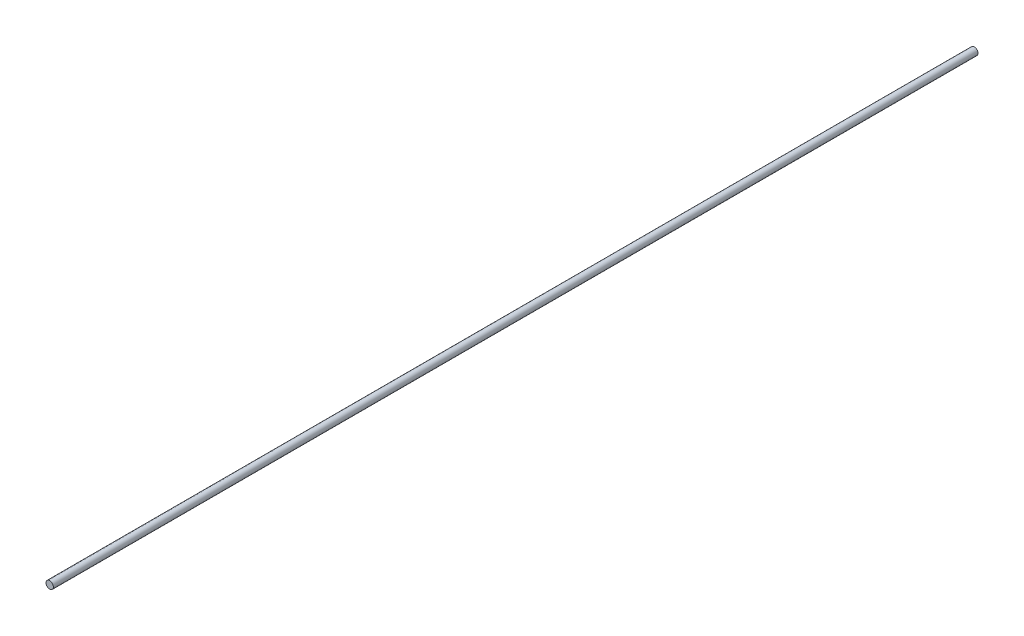
ISO-10303-21;
HEADER;
FILE_DESCRIPTION(('STEP AP214'),'2;1');
FILE_NAME('part.step','',(''),(''),'','','');
FILE_SCHEMA(('AUTOMOTIVE_DESIGN { 1 0 10303 214 1 1 1 1 }'));
ENDSEC;
DATA;
#1=APPLICATION_CONTEXT('core data for automotive mechanical design processes');
#2=APPLICATION_PROTOCOL_DEFINITION('international standard','automotive_design',2000,#1);
#3=PRODUCT_CONTEXT('',#1,'mechanical');
#4=PRODUCT('Part','Part','',(#3));
#5=PRODUCT_RELATED_PRODUCT_CATEGORY('part','',(#4));
#6=PRODUCT_DEFINITION_FORMATION('','',#4);
#7=PRODUCT_DEFINITION_CONTEXT('part definition',#1,'design');
#8=PRODUCT_DEFINITION('design','',#6,#7);
#9=PRODUCT_DEFINITION_SHAPE('','',#8);
#10=(LENGTH_UNIT() NAMED_UNIT(*) SI_UNIT(.MILLI.,.METRE.));
#11=(NAMED_UNIT(*) PLANE_ANGLE_UNIT() SI_UNIT($,.RADIAN.));
#12=(NAMED_UNIT(*) SI_UNIT($,.STERADIAN.) SOLID_ANGLE_UNIT());
#13=UNCERTAINTY_MEASURE_WITH_UNIT(LENGTH_MEASURE(1.E-05),#10,'distance_accuracy_value','');
#14=(GEOMETRIC_REPRESENTATION_CONTEXT(3) GLOBAL_UNCERTAINTY_ASSIGNED_CONTEXT((#13)) GLOBAL_UNIT_ASSIGNED_CONTEXT((#10,
#11,#12)) REPRESENTATION_CONTEXT('',''));
#15=CARTESIAN_POINT('',(0.,0.,0.));
#16=DIRECTION('',(0.,0.,1.));
#17=DIRECTION('',(1.,0.,0.));
#18=AXIS2_PLACEMENT_3D('',#15,#16,#17);
#19=CARTESIAN_POINT('',(0.,0.,500.));
#20=DIRECTION('',(0.,0.,-1.));
#21=DIRECTION('',(-1.,0.,0.));
#22=AXIS2_PLACEMENT_3D('',#19,#20,#21);
#23=CYLINDRICAL_SURFACE('',#22,4.);
#24=CARTESIAN_POINT('',(0.,0.,500.));
#25=DIRECTION('',(0.,0.,1.));
#26=DIRECTION('',(1.,0.,0.));
#27=AXIS2_PLACEMENT_3D('',#24,#25,#26);
#28=CIRCLE('',#27,4.);
#29=CARTESIAN_POINT('',(4.,0.,500.));
#30=VERTEX_POINT('',#29);
#31=EDGE_CURVE('E10',#30,#30,#28,.T.);
#32=ORIENTED_EDGE('',*,*,#31,.F.);
#33=EDGE_LOOP('',(#32));
#34=FACE_BOUND('',#33,.T.);
#35=CARTESIAN_POINT('',(0.,0.,-500.));
#36=DIRECTION('',(0.,0.,1.));
#37=DIRECTION('',(1.,0.,0.));
#38=AXIS2_PLACEMENT_3D('',#35,#36,#37);
#39=CIRCLE('',#38,4.);
#40=CARTESIAN_POINT('',(4.,0.,-500.));
#41=VERTEX_POINT('',#40);
#42=EDGE_CURVE('E43',#41,#41,#39,.T.);
#43=ORIENTED_EDGE('',*,*,#42,.T.);
#44=EDGE_LOOP('',(#43));
#45=FACE_BOUND('',#44,.T.);
#46=ADVANCED_FACE('F40',(#34,#45),#23,.T.);
#47=CARTESIAN_POINT('',(0.,0.,500.));
#48=DIRECTION('',(0.,0.,1.));
#49=DIRECTION('',(1.,0.,0.));
#50=AXIS2_PLACEMENT_3D('',#47,#48,#49);
#51=PLANE('',#50);
#52=ORIENTED_EDGE('',*,*,#31,.T.);
#53=EDGE_LOOP('',(#52));
#54=FACE_BOUND('',#53,.T.);
#55=ADVANCED_FACE('F55',(#54),#51,.T.);
#56=CARTESIAN_POINT('',(0.,0.,-500.));
#57=DIRECTION('',(0.,0.,1.));
#58=DIRECTION('',(1.,0.,0.));
#59=AXIS2_PLACEMENT_3D('',#56,#57,#58);
#60=PLANE('',#59);
#61=ORIENTED_EDGE('',*,*,#42,.F.);
#62=EDGE_LOOP('',(#61));
#63=FACE_BOUND('',#62,.T.);
#64=ADVANCED_FACE('F53',(#63),#60,.F.);
#65=CLOSED_SHELL('',(#46,#55,#64));
#66=MANIFOLD_SOLID_BREP('B2',#65);
#67=ADVANCED_BREP_SHAPE_REPRESENTATION('',(#18,#66),#14);
#68=SHAPE_DEFINITION_REPRESENTATION(#9,#67);
ENDSEC;
END-ISO-10303-21;
